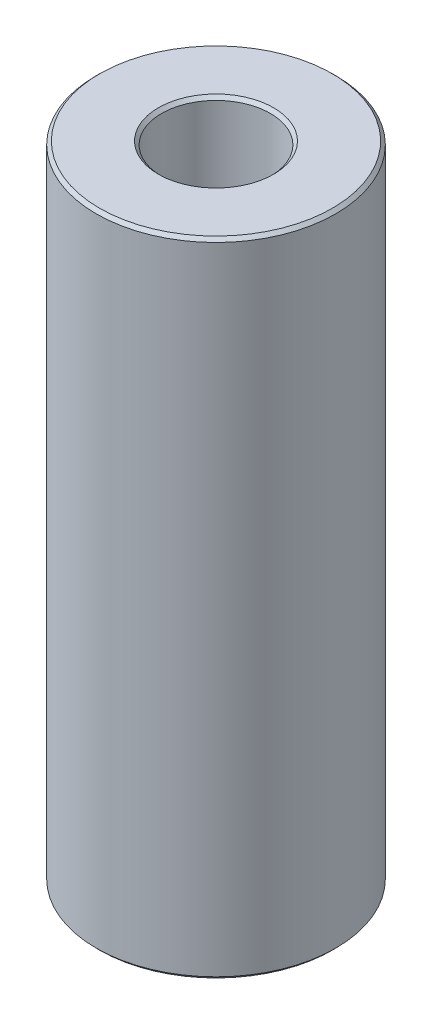
ISO-10303-21;
HEADER;
FILE_DESCRIPTION(('STEP AP214'),'2;1');
FILE_NAME('part.step','',(''),(''),'','','');
FILE_SCHEMA(('AUTOMOTIVE_DESIGN { 1 0 10303 214 1 1 1 1 }'));
ENDSEC;
DATA;
#1=APPLICATION_CONTEXT('core data for automotive mechanical design processes');
#2=APPLICATION_PROTOCOL_DEFINITION('international standard','automotive_design',2000,#1);
#3=PRODUCT_CONTEXT('',#1,'mechanical');
#4=PRODUCT('Part','Part','',(#3));
#5=PRODUCT_RELATED_PRODUCT_CATEGORY('part','',(#4));
#6=PRODUCT_DEFINITION_FORMATION('','',#4);
#7=PRODUCT_DEFINITION_CONTEXT('part definition',#1,'design');
#8=PRODUCT_DEFINITION('design','',#6,#7);
#9=PRODUCT_DEFINITION_SHAPE('','',#8);
#10=(LENGTH_UNIT() NAMED_UNIT(*) SI_UNIT(.MILLI.,.METRE.));
#11=(NAMED_UNIT(*) PLANE_ANGLE_UNIT() SI_UNIT($,.RADIAN.));
#12=(NAMED_UNIT(*) SI_UNIT($,.STERADIAN.) SOLID_ANGLE_UNIT());
#13=UNCERTAINTY_MEASURE_WITH_UNIT(LENGTH_MEASURE(1.E-05),#10,'distance_accuracy_value','');
#14=(GEOMETRIC_REPRESENTATION_CONTEXT(3) GLOBAL_UNCERTAINTY_ASSIGNED_CONTEXT((#13)) GLOBAL_UNIT_ASSIGNED_CONTEXT((#10,
#11,#12)) REPRESENTATION_CONTEXT('',''));
#15=CARTESIAN_POINT('',(0.,0.,0.));
#16=DIRECTION('',(0.,0.,1.));
#17=DIRECTION('',(1.,0.,0.));
#18=AXIS2_PLACEMENT_3D('',#15,#16,#17);
#19=CARTESIAN_POINT('',(0.,295.099877021182,0.));
#20=DIRECTION('',(0.,-1.,0.));
#21=DIRECTION('',(0.,0.,-1.));
#22=AXIS2_PLACEMENT_3D('',#19,#20,#21);
#23=CYLINDRICAL_SURFACE('',#22,55.);
#24=CARTESIAN_POINT('',(0.,1.51528043169685,0.));
#25=DIRECTION('',(0.,1.,0.));
#26=DIRECTION('',(0.,0.,1.));
#27=AXIS2_PLACEMENT_3D('',#24,#25,#26);
#28=CIRCLE('',#27,55.);
#29=CARTESIAN_POINT('',(0.,1.51528043169685,55.));
#30=VERTEX_POINT('',#29);
#31=EDGE_CURVE('E10',#30,#30,#28,.T.);
#32=ORIENTED_EDGE('',*,*,#31,.T.);
#33=EDGE_LOOP('',(#32));
#34=FACE_BOUND('',#33,.T.);
#35=CARTESIAN_POINT('',(0.,293.6165373761,0.));
#36=DIRECTION('',(0.,1.,0.));
#37=DIRECTION('',(0.,0.,1.));
#38=AXIS2_PLACEMENT_3D('',#35,#36,#37);
#39=CIRCLE('',#38,55.);
#40=CARTESIAN_POINT('',(0.,293.6165373761,55.));
#41=VERTEX_POINT('',#40);
#42=EDGE_CURVE('E50',#41,#41,#39,.F.);
#43=ORIENTED_EDGE('',*,*,#42,.T.);
#44=EDGE_LOOP('',(#43));
#45=FACE_BOUND('',#44,.T.);
#46=ADVANCED_FACE('F39',(#34,#45),#23,.T.);
#47=CARTESIAN_POINT('',(0.,295.099877021182,0.));
#48=DIRECTION('',(0.,1.,0.));
#49=DIRECTION('',(0.,0.,1.));
#50=AXIS2_PLACEMENT_3D('',#47,#48,#49);
#51=PLANE('',#50);
#52=CARTESIAN_POINT('',(0.,295.099877021182,0.));
#53=DIRECTION('',(0.,1.,0.));
#54=DIRECTION('',(0.,0.,1.));
#55=AXIS2_PLACEMENT_3D('',#52,#53,#54);
#56=CIRCLE('',#55,26.4724948991539);
#57=CARTESIAN_POINT('',(0.,295.099877021182,26.4724948991538));
#58=VERTEX_POINT('',#57);
#59=EDGE_CURVE('E58',#58,#58,#56,.F.);
#60=ORIENTED_EDGE('',*,*,#59,.T.);
#61=EDGE_LOOP('',(#60));
#62=FACE_BOUND('',#61,.T.);
#63=CARTESIAN_POINT('',(0.,295.099877021182,0.));
#64=DIRECTION('',(0.,1.,0.));
#65=DIRECTION('',(0.,0.,1.));
#66=AXIS2_PLACEMENT_3D('',#63,#64,#65);
#67=CIRCLE('',#66,53.4847195683031);
#68=CARTESIAN_POINT('',(0.,295.099877021182,53.4847195683031));
#69=VERTEX_POINT('',#68);
#70=EDGE_CURVE('E61',#69,#69,#67,.T.);
#71=ORIENTED_EDGE('',*,*,#70,.T.);
#72=EDGE_LOOP('',(#71));
#73=FACE_BOUND('',#72,.T.);
#74=ADVANCED_FACE('F88',(#62,#73),#51,.T.);
#75=CARTESIAN_POINT('',(0.,0.,0.));
#76=DIRECTION('',(0.,1.,0.));
#77=DIRECTION('',(0.,0.,1.));
#78=AXIS2_PLACEMENT_3D('',#75,#76,#77);
#79=PLANE('',#78);
#80=CARTESIAN_POINT('',(0.,0.,0.));
#81=DIRECTION('',(0.,1.,0.));
#82=DIRECTION('',(0.,0.,1.));
#83=AXIS2_PLACEMENT_3D('',#80,#81,#82);
#84=CIRCLE('',#83,26.5044356857682);
#85=CARTESIAN_POINT('',(0.,0.,26.5044356857682));
#86=VERTEX_POINT('',#85);
#87=EDGE_CURVE('E51',#86,#86,#84,.T.);
#88=ORIENTED_EDGE('',*,*,#87,.T.);
#89=EDGE_LOOP('',(#88));
#90=FACE_BOUND('',#89,.T.);
#91=CARTESIAN_POINT('',(0.,0.,0.));
#92=DIRECTION('',(0.,1.,0.));
#93=DIRECTION('',(0.,0.,1.));
#94=AXIS2_PLACEMENT_3D('',#91,#92,#93);
#95=CIRCLE('',#94,53.5166603549174);
#96=CARTESIAN_POINT('',(0.,0.,53.5166603549174));
#97=VERTEX_POINT('',#96);
#98=EDGE_CURVE('E54',#97,#97,#95,.F.);
#99=ORIENTED_EDGE('',*,*,#98,.T.);
#100=EDGE_LOOP('',(#99));
#101=FACE_BOUND('',#100,.T.);
#102=ADVANCED_FACE('F83',(#90,#101),#79,.F.);
#103=CARTESIAN_POINT('',(0.,295.099877021182,0.));
#104=DIRECTION('',(0.,-1.,0.));
#105=DIRECTION('',(0.,0.,-1.));
#106=AXIS2_PLACEMENT_3D('',#103,#104,#105);
#107=CYLINDRICAL_SURFACE('',#106,24.9891552540712);
#108=CARTESIAN_POINT('',(0.,293.584596589485,0.));
#109=DIRECTION('',(0.,1.,0.));
#110=DIRECTION('',(0.,0.,1.));
#111=AXIS2_PLACEMENT_3D('',#108,#109,#110);
#112=CIRCLE('',#111,24.9891552540712);
#113=CARTESIAN_POINT('',(0.,293.584596589485,24.9891552540712));
#114=VERTEX_POINT('',#113);
#115=EDGE_CURVE('E67',#114,#114,#112,.T.);
#116=ORIENTED_EDGE('',*,*,#115,.T.);
#117=EDGE_LOOP('',(#116));
#118=FACE_BOUND('',#117,.T.);
#119=CARTESIAN_POINT('',(0.,1.48333964508263,0.));
#120=DIRECTION('',(0.,1.,0.));
#121=DIRECTION('',(0.,0.,1.));
#122=AXIS2_PLACEMENT_3D('',#119,#120,#121);
#123=CIRCLE('',#122,24.9891552540712);
#124=CARTESIAN_POINT('',(0.,1.48333964508263,24.9891552540712));
#125=VERTEX_POINT('',#124);
#126=EDGE_CURVE('E69',#125,#125,#123,.F.);
#127=ORIENTED_EDGE('',*,*,#126,.T.);
#128=EDGE_LOOP('',(#127));
#129=FACE_BOUND('',#128,.T.);
#130=ADVANCED_FACE('F71',(#118,#129),#107,.F.);
#131=CARTESIAN_POINT('',(0.,293.584596589485,0.));
#132=DIRECTION('',(0.,1.,0.));
#133=DIRECTION('',(0.,0.,1.));
#134=AXIS2_PLACEMENT_3D('',#131,#132,#133);
#135=CONICAL_SURFACE('',#134,24.9891552540712,0.774746737787419);
#136=CARTESIAN_POINT('',(0.,295.099877021182,26.4724948991538));
#137=CARTESIAN_POINT('',(0.,295.084092850019,26.4570434445176));
#138=CARTESIAN_POINT('',(0.,295.068308678855,26.4415919898813));
#139=CARTESIAN_POINT('',(0.,295.036740336528,26.4106890806087));
#140=CARTESIAN_POINT('',(0.,295.020956165365,26.3952376259725));
#141=CARTESIAN_POINT('',(0.,294.989387823038,26.3643347166999));
#142=CARTESIAN_POINT('',(0.,294.973603651874,26.3488832620636));
#143=CARTESIAN_POINT('',(0.,294.942035309547,26.3179803527911));
#144=CARTESIAN_POINT('',(0.,294.926251138384,26.3025288981548));
#145=CARTESIAN_POINT('',(0.,294.894682796057,26.2716259888822));
#146=CARTESIAN_POINT('',(0.,294.878898624893,26.256174534246));
#147=CARTESIAN_POINT('',(0.,294.847330282566,26.2252716249734));
#148=CARTESIAN_POINT('',(0.,294.831546111403,26.2098201703371));
#149=CARTESIAN_POINT('',(0.,294.799977769076,26.1789172610646));
#150=CARTESIAN_POINT('',(0.,294.784193597912,26.1634658064283));
#151=CARTESIAN_POINT('',(0.,294.752625255585,26.1325628971557));
#152=CARTESIAN_POINT('',(0.,294.736841084421,26.1171114425195));
#153=CARTESIAN_POINT('',(0.,294.705272742095,26.0862085332469));
#154=CARTESIAN_POINT('',(0.,294.689488570931,26.0707570786106));
#155=CARTESIAN_POINT('',(0.,294.657920228604,26.0398541693381));
#156=CARTESIAN_POINT('',(0.,294.64213605744,26.0244027147018));
#157=CARTESIAN_POINT('',(0.,294.610567715113,25.9934998054292));
#158=CARTESIAN_POINT('',(0.,294.59478354395,25.978048350793));
#159=CARTESIAN_POINT('',(0.,294.563215201623,25.9471454415204));
#160=CARTESIAN_POINT('',(0.,294.547431030459,25.9316939868841));
#161=CARTESIAN_POINT('',(0.,294.515862688132,25.9007910776116));
#162=CARTESIAN_POINT('',(0.,294.500078516969,25.8853396229753));
#163=CARTESIAN_POINT('',(0.,294.468510174642,25.8544367137027));
#164=CARTESIAN_POINT('',(0.,294.452726003478,25.8389852590665));
#165=CARTESIAN_POINT('',(0.,294.421157661151,25.8080823497939));
#166=CARTESIAN_POINT('',(0.,294.405373489988,25.7926308951576));
#167=CARTESIAN_POINT('',(0.,294.373805147661,25.7617279858851));
#168=CARTESIAN_POINT('',(0.,294.358020976497,25.7462765312488));
#169=CARTESIAN_POINT('',(0.,294.32645263417,25.7153736219762));
#170=CARTESIAN_POINT('',(0.,294.310668463007,25.69992216734));
#171=CARTESIAN_POINT('',(0.,294.27910012068,25.6690192580674));
#172=CARTESIAN_POINT('',(0.,294.263315949516,25.6535678034311));
#173=CARTESIAN_POINT('',(0.,294.231747607189,25.6226648941586));
#174=CARTESIAN_POINT('',(0.,294.215963436026,25.6072134395223));
#175=CARTESIAN_POINT('',(0.,294.184395093699,25.5763105302497));
#176=CARTESIAN_POINT('',(0.,294.168610922535,25.5608590756135));
#177=CARTESIAN_POINT('',(0.,294.137042580208,25.5299561663409));
#178=CARTESIAN_POINT('',(0.,294.121258409045,25.5145047117046));
#179=CARTESIAN_POINT('',(0.,294.089690066718,25.4836018024321));
#180=CARTESIAN_POINT('',(0.,294.073905895554,25.4681503477958));
#181=CARTESIAN_POINT('',(0.,294.042337553227,25.4372474385232));
#182=CARTESIAN_POINT('',(0.,294.026553382064,25.421795983887));
#183=CARTESIAN_POINT('',(0.,293.994985039737,25.3908930746144));
#184=CARTESIAN_POINT('',(0.,293.979200868573,25.3754416199781));
#185=CARTESIAN_POINT('',(0.,293.947632526246,25.3445387107056));
#186=CARTESIAN_POINT('',(0.,293.931848355083,25.3290872560693));
#187=CARTESIAN_POINT('',(0.,293.900280012756,25.2981843467967));
#188=CARTESIAN_POINT('',(0.,293.884495841592,25.2827328921605));
#189=CARTESIAN_POINT('',(0.,293.852927499265,25.2518299828879));
#190=CARTESIAN_POINT('',(0.,293.837143328101,25.2363785282516));
#191=CARTESIAN_POINT('',(0.,293.805574985774,25.2054756189791));
#192=CARTESIAN_POINT('',(0.,293.789790814611,25.1900241643428));
#193=CARTESIAN_POINT('',(0.,293.758222472284,25.1591212550702));
#194=CARTESIAN_POINT('',(0.,293.74243830112,25.143669800434));
#195=CARTESIAN_POINT('',(0.,293.710869958793,25.1127668911614));
#196=CARTESIAN_POINT('',(0.,293.69508578763,25.0973154365251));
#197=CARTESIAN_POINT('',(0.,293.663517445303,25.0664125272526));
#198=CARTESIAN_POINT('',(0.,293.647733274139,25.0509610726163));
#199=CARTESIAN_POINT('',(0.,293.616164931812,25.0200581633437));
#200=CARTESIAN_POINT('',(0.,293.600380760649,25.0046067087075));
#201=CARTESIAN_POINT('',(0.,293.584596589485,24.9891552540712));
#202=B_SPLINE_CURVE_WITH_KNOTS('',3,(#136,#137,#138,#139,#140,#141,#142,#143,#144,#145,#146,
#147,#148,#149,#150,#151,#152,#153,#154,#155,#156,#157,#158,#159,#160,#161,#162,#163,#164,#165,
#166,#167,#168,#169,#170,#171,#172,#173,#174,#175,#176,#177,#178,#179,#180,#181,#182,#183,#184,
#185,#186,#187,#188,#189,#190,#191,#192,#193,#194,#195,#196,#197,#198,#199,#200,#201),
.UNSPECIFIED.,.F.,.F.,(4,2,2,2,2,2,2,2,2,2,2,2,2,2,2,2,2,2,2,2,2,2,2,2,2,2,2,2,2,2,2,2,4),(0.,
0.0662645273677279,0.132529054735416,0.198793582103107,0.265058109470795,0.331322636838483,
0.397587164206172,0.463851691573862,0.530116218941551,0.596380746309239,0.662645273676927,
0.728909801044618,0.795174328412306,0.861438855779994,0.927703383147685,0.993967910515373,
1.06023243788306,1.12649696525075,1.19276149261844,1.25902601998613,1.32529054735382,
1.39155507472151,1.4578196020892,1.52408412945688,1.59034865682457,1.65661318419226,
1.72287771155995,1.78914223892764,1.85540676629533,1.92167129366302,1.98793582103071,
2.0542003483984,2.12046487576609),.UNSPECIFIED.);
#203=EDGE_CURVE('BSEAM77',#58,#114,#202,.T.);
#204=ORIENTED_EDGE('',*,*,#59,.F.);
#205=ORIENTED_EDGE('',*,*,#115,.F.);
#206=ORIENTED_EDGE('',*,*,#203,.T.);
#207=ORIENTED_EDGE('',*,*,#203,.F.);
#208=EDGE_LOOP('',(#204,#206,#205,#207));
#209=FACE_BOUND('',#208,.T.);
#210=ADVANCED_FACE('F77',(#209),#135,.F.);
#211=CARTESIAN_POINT('',(0.,0.,0.));
#212=DIRECTION('',(0.,-1.,0.));
#213=DIRECTION('',(0.,0.,-1.));
#214=AXIS2_PLACEMENT_3D('',#211,#212,#213);
#215=CONICAL_SURFACE('',#214,26.5044356857682,0.79604958900748);
#216=ORIENTED_EDGE('',*,*,#126,.F.);
#217=EDGE_LOOP('',(#216));
#218=FACE_BOUND('',#217,.T.);
#219=ORIENTED_EDGE('',*,*,#87,.F.);
#220=EDGE_LOOP('',(#219));
#221=FACE_BOUND('',#220,.T.);
#222=ADVANCED_FACE('F73',(#218,#221),#215,.F.);
#223=CARTESIAN_POINT('',(0.,1.51528043169685,0.));
#224=DIRECTION('',(0.,1.,0.));
#225=DIRECTION('',(0.,0.,1.));
#226=AXIS2_PLACEMENT_3D('',#223,#224,#225);
#227=CONICAL_SURFACE('',#226,55.,0.774746737787429);
#228=ORIENTED_EDGE('',*,*,#98,.F.);
#229=EDGE_LOOP('',(#228));
#230=FACE_BOUND('',#229,.T.);
#231=ORIENTED_EDGE('',*,*,#31,.F.);
#232=EDGE_LOOP('',(#231));
#233=FACE_BOUND('',#232,.T.);
#234=ADVANCED_FACE('F76',(#230,#233),#227,.T.);
#235=CARTESIAN_POINT('',(0.,295.099877021182,0.));
#236=DIRECTION('',(0.,-1.,0.));
#237=DIRECTION('',(0.,0.,-1.));
#238=AXIS2_PLACEMENT_3D('',#235,#236,#237);
#239=CONICAL_SURFACE('',#238,53.4847195683031,0.796049589007475);
#240=ORIENTED_EDGE('',*,*,#42,.F.);
#241=EDGE_LOOP('',(#240));
#242=FACE_BOUND('',#241,.T.);
#243=ORIENTED_EDGE('',*,*,#70,.F.);
#244=EDGE_LOOP('',(#243));
#245=FACE_BOUND('',#244,.T.);
#246=ADVANCED_FACE('F45',(#242,#245),#239,.T.);
#247=CLOSED_SHELL('',(#46,#74,#102,#130,#210,#222,#234,#246));
#248=MANIFOLD_SOLID_BREP('B2',#247);
#249=ADVANCED_BREP_SHAPE_REPRESENTATION('',(#18,#248),#14);
#250=SHAPE_DEFINITION_REPRESENTATION(#9,#249);
ENDSEC;
END-ISO-10303-21;
